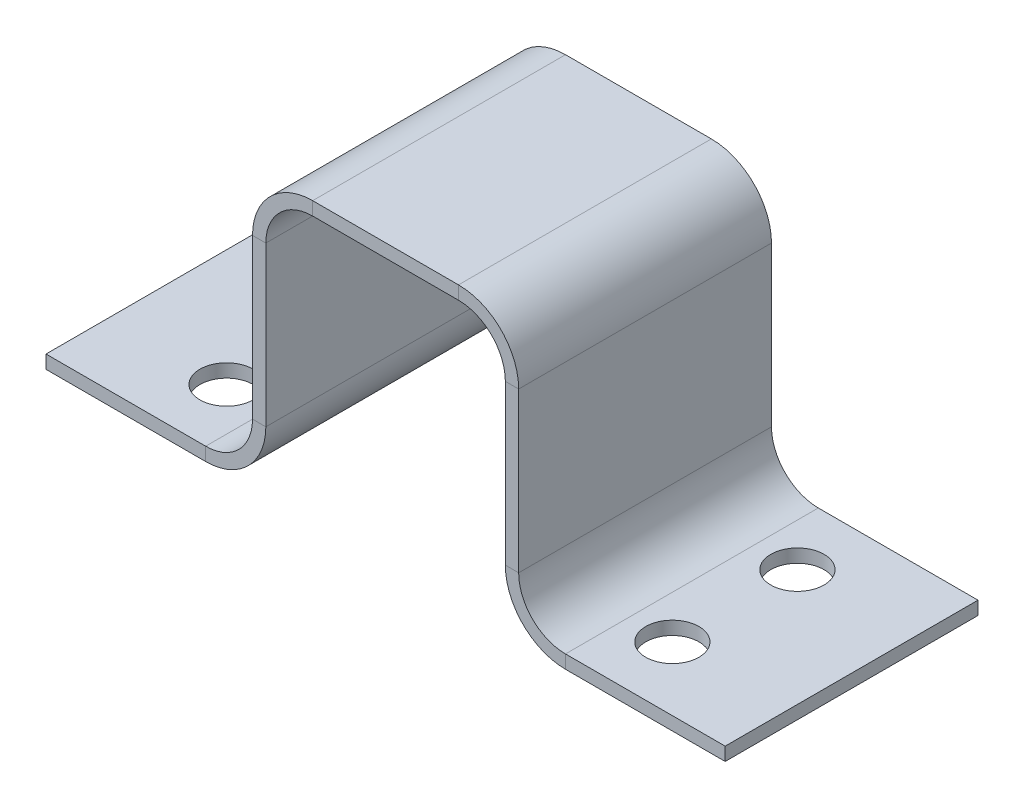
ISO-10303-21;
HEADER;
FILE_DESCRIPTION(('STEP AP214'),'2;1');
FILE_NAME('part.step','',(''),(''),'','','');
FILE_SCHEMA(('AUTOMOTIVE_DESIGN { 1 0 10303 214 1 1 1 1 }'));
ENDSEC;
DATA;
#1=APPLICATION_CONTEXT('core data for automotive mechanical design processes');
#2=APPLICATION_PROTOCOL_DEFINITION('international standard','automotive_design',2000,#1);
#3=PRODUCT_CONTEXT('',#1,'mechanical');
#4=PRODUCT('Part','Part','',(#3));
#5=PRODUCT_RELATED_PRODUCT_CATEGORY('part','',(#4));
#6=PRODUCT_DEFINITION_FORMATION('','',#4);
#7=PRODUCT_DEFINITION_CONTEXT('part definition',#1,'design');
#8=PRODUCT_DEFINITION('design','',#6,#7);
#9=PRODUCT_DEFINITION_SHAPE('','',#8);
#10=(LENGTH_UNIT() NAMED_UNIT(*) SI_UNIT(.MILLI.,.METRE.));
#11=(NAMED_UNIT(*) PLANE_ANGLE_UNIT() SI_UNIT($,.RADIAN.));
#12=(NAMED_UNIT(*) SI_UNIT($,.STERADIAN.) SOLID_ANGLE_UNIT());
#13=UNCERTAINTY_MEASURE_WITH_UNIT(LENGTH_MEASURE(1.E-05),#10,'distance_accuracy_value','');
#14=(GEOMETRIC_REPRESENTATION_CONTEXT(3) GLOBAL_UNCERTAINTY_ASSIGNED_CONTEXT((#13)) GLOBAL_UNIT_ASSIGNED_CONTEXT((#10,
#11,#12)) REPRESENTATION_CONTEXT('',''));
#15=CARTESIAN_POINT('',(0.,0.,0.));
#16=DIRECTION('',(0.,0.,1.));
#17=DIRECTION('',(1.,0.,0.));
#18=AXIS2_PLACEMENT_3D('',#15,#16,#17);
#19=CARTESIAN_POINT('',(-40.513,1.5875,15.08125));
#20=DIRECTION('',(-1.,0.,0.));
#21=DIRECTION('',(0.,0.,-1.));
#22=AXIS2_PLACEMENT_3D('',#19,#20,#21);
#23=PLANE('',#22);
#24=DIRECTION('',(0.,1.,0.));
#25=VECTOR('',#24,1.);
#26=CARTESIAN_POINT('',(-40.513,1.5875,-15.08125));
#27=LINE('',#26,#25);
#28=CARTESIAN_POINT('',(-40.513,0.,-15.08125));
#29=VERTEX_POINT('',#28);
#30=CARTESIAN_POINT('',(-40.513,1.5875,-15.08125));
#31=VERTEX_POINT('',#30);
#32=EDGE_CURVE('E11',#29,#31,#27,.T.);
#33=ORIENTED_EDGE('',*,*,#32,.F.);
#34=DIRECTION('',(0.,0.,-1.));
#35=VECTOR('',#34,1.);
#36=CARTESIAN_POINT('',(-40.513,0.,15.08125));
#37=LINE('',#36,#35);
#38=CARTESIAN_POINT('',(-40.513,0.,15.08125));
#39=VERTEX_POINT('',#38);
#40=EDGE_CURVE('E123',#39,#29,#37,.T.);
#41=ORIENTED_EDGE('',*,*,#40,.F.);
#42=DIRECTION('',(0.,1.,0.));
#43=VECTOR('',#42,1.);
#44=CARTESIAN_POINT('',(-40.513,1.5875,15.08125));
#45=LINE('',#44,#43);
#46=CARTESIAN_POINT('',(-40.513,1.5875,15.08125));
#47=VERTEX_POINT('',#46);
#48=EDGE_CURVE('E49',#39,#47,#45,.T.);
#49=ORIENTED_EDGE('',*,*,#48,.T.);
#50=DIRECTION('',(0.,0.,-1.));
#51=VECTOR('',#50,1.);
#52=CARTESIAN_POINT('',(-40.513,1.5875,15.08125));
#53=LINE('',#52,#51);
#54=EDGE_CURVE('E126',#47,#31,#53,.T.);
#55=ORIENTED_EDGE('',*,*,#54,.T.);
#56=EDGE_LOOP('',(#33,#41,#49,#55));
#57=FACE_BOUND('',#56,.T.);
#58=ADVANCED_FACE('F39',(#57),#23,.T.);
#59=CARTESIAN_POINT('',(-40.513,1.5875,15.08125));
#60=DIRECTION('',(0.,0.,1.));
#61=DIRECTION('',(-1.,0.,0.));
#62=AXIS2_PLACEMENT_3D('',#59,#60,#61);
#63=PLANE('',#62);
#64=ORIENTED_EDGE('',*,*,#48,.F.);
#65=DIRECTION('',(1.,0.,0.));
#66=VECTOR('',#65,1.);
#67=CARTESIAN_POINT('',(-40.513,0.,15.08125));
#68=LINE('',#67,#66);
#69=CARTESIAN_POINT('',(-21.463,0.,15.08125));
#70=VERTEX_POINT('',#69);
#71=EDGE_CURVE('E138',#70,#39,#68,.F.);
#72=ORIENTED_EDGE('',*,*,#71,.F.);
#73=DIRECTION('',(0.,1.,0.));
#74=VECTOR('',#73,1.);
#75=CARTESIAN_POINT('',(-21.463,1.5875,15.08125));
#76=LINE('',#75,#74);
#77=CARTESIAN_POINT('',(-21.463,1.5875,15.08125));
#78=VERTEX_POINT('',#77);
#79=EDGE_CURVE('E208',#70,#78,#76,.T.);
#80=ORIENTED_EDGE('',*,*,#79,.T.);
#81=DIRECTION('',(-1.,0.,0.));
#82=VECTOR('',#81,1.);
#83=CARTESIAN_POINT('',(-40.513,1.5875,15.08125));
#84=LINE('',#83,#82);
#85=EDGE_CURVE('E216',#78,#47,#84,.T.);
#86=ORIENTED_EDGE('',*,*,#85,.T.);
#87=EDGE_LOOP('',(#64,#72,#80,#86));
#88=FACE_BOUND('',#87,.T.);
#89=ADVANCED_FACE('F220',(#88),#63,.T.);
#90=CARTESIAN_POINT('',(-21.463,7.17549999999999,15.08125));
#91=DIRECTION('',(0.,0.,1.));
#92=DIRECTION('',(1.,0.,0.));
#93=AXIS2_PLACEMENT_3D('',#90,#91,#92);
#94=PLANE('',#93);
#95=ORIENTED_EDGE('',*,*,#79,.F.);
#96=CARTESIAN_POINT('',(-21.463,7.17549999999999,15.08125));
#97=DIRECTION('',(0.,0.,-1.));
#98=DIRECTION('',(-1.,0.,0.));
#99=AXIS2_PLACEMENT_3D('',#96,#97,#98);
#100=CIRCLE('',#99,7.1755);
#101=CARTESIAN_POINT('',(-14.2875,7.17549999999999,15.08125));
#102=VERTEX_POINT('',#101);
#103=EDGE_CURVE('E264',#102,#70,#100,.T.);
#104=ORIENTED_EDGE('',*,*,#103,.F.);
#105=DIRECTION('',(-1.,0.,0.));
#106=VECTOR('',#105,1.);
#107=CARTESIAN_POINT('',(-15.875,7.17549999999999,15.08125));
#108=LINE('',#107,#106);
#109=CARTESIAN_POINT('',(-15.875,7.17549999999999,15.08125));
#110=VERTEX_POINT('',#109);
#111=EDGE_CURVE('E205',#102,#110,#108,.T.);
#112=ORIENTED_EDGE('',*,*,#111,.T.);
#113=CARTESIAN_POINT('',(-21.463,7.17549999999999,15.08125));
#114=DIRECTION('',(0.,0.,-1.));
#115=DIRECTION('',(1.,0.,0.));
#116=AXIS2_PLACEMENT_3D('',#113,#114,#115);
#117=CIRCLE('',#116,5.588);
#118=EDGE_CURVE('E228',#110,#78,#117,.T.);
#119=ORIENTED_EDGE('',*,*,#118,.T.);
#120=EDGE_LOOP('',(#95,#104,#112,#119));
#121=FACE_BOUND('',#120,.T.);
#122=ADVANCED_FACE('F410',(#121),#94,.T.);
#123=CARTESIAN_POINT('',(-15.875,7.17549999999999,15.08125));
#124=DIRECTION('',(0.,0.,1.));
#125=DIRECTION('',(0.,-1.,0.));
#126=AXIS2_PLACEMENT_3D('',#123,#124,#125);
#127=PLANE('',#126);
#128=ORIENTED_EDGE('',*,*,#111,.F.);
#129=DIRECTION('',(0.,1.,0.));
#130=VECTOR('',#129,1.);
#131=CARTESIAN_POINT('',(-14.2875,7.17549999999999,15.08125));
#132=LINE('',#131,#130);
#133=CARTESIAN_POINT('',(-14.2875,26.162,15.08125));
#134=VERTEX_POINT('',#133);
#135=EDGE_CURVE('E236',#134,#102,#132,.F.);
#136=ORIENTED_EDGE('',*,*,#135,.F.);
#137=DIRECTION('',(-1.,0.,0.));
#138=VECTOR('',#137,1.);
#139=CARTESIAN_POINT('',(-15.875,26.162,15.08125));
#140=LINE('',#139,#138);
#141=CARTESIAN_POINT('',(-15.875,26.162,15.08125));
#142=VERTEX_POINT('',#141);
#143=EDGE_CURVE('E202',#134,#142,#140,.T.);
#144=ORIENTED_EDGE('',*,*,#143,.T.);
#145=DIRECTION('',(0.,-1.,0.));
#146=VECTOR('',#145,1.);
#147=CARTESIAN_POINT('',(-15.875,7.17549999999999,15.08125));
#148=LINE('',#147,#146);
#149=EDGE_CURVE('E344',#142,#110,#148,.T.);
#150=ORIENTED_EDGE('',*,*,#149,.T.);
#151=EDGE_LOOP('',(#128,#136,#144,#150));
#152=FACE_BOUND('',#151,.T.);
#153=ADVANCED_FACE('F543',(#152),#127,.T.);
#154=CARTESIAN_POINT('',(-8.6995,26.162,15.08125));
#155=DIRECTION('',(0.,0.,-1.));
#156=DIRECTION('',(-1.,0.,0.));
#157=AXIS2_PLACEMENT_3D('',#154,#155,#156);
#158=PLANE('',#157);
#159=ORIENTED_EDGE('',*,*,#143,.F.);
#160=CARTESIAN_POINT('',(-8.6995,26.162,15.08125));
#161=DIRECTION('',(0.,0.,-1.));
#162=DIRECTION('',(-1.,0.,0.));
#163=AXIS2_PLACEMENT_3D('',#160,#161,#162);
#164=CIRCLE('',#163,5.588);
#165=CARTESIAN_POINT('',(-8.6995,31.75,15.08125));
#166=VERTEX_POINT('',#165);
#167=EDGE_CURVE('E156',#166,#134,#164,.F.);
#168=ORIENTED_EDGE('',*,*,#167,.F.);
#169=DIRECTION('',(0.,1.,0.));
#170=VECTOR('',#169,1.);
#171=CARTESIAN_POINT('',(-8.6995,33.3375,15.08125));
#172=LINE('',#171,#170);
#173=CARTESIAN_POINT('',(-8.6995,33.3375,15.08125));
#174=VERTEX_POINT('',#173);
#175=EDGE_CURVE('E199',#166,#174,#172,.T.);
#176=ORIENTED_EDGE('',*,*,#175,.T.);
#177=CARTESIAN_POINT('',(-8.6995,26.162,15.08125));
#178=DIRECTION('',(0.,0.,1.));
#179=DIRECTION('',(-1.,0.,0.));
#180=AXIS2_PLACEMENT_3D('',#177,#178,#179);
#181=CIRCLE('',#180,7.1755);
#182=EDGE_CURVE('E353',#174,#142,#181,.T.);
#183=ORIENTED_EDGE('',*,*,#182,.T.);
#184=EDGE_LOOP('',(#159,#168,#176,#183));
#185=FACE_BOUND('',#184,.T.);
#186=ADVANCED_FACE('F540',(#185),#158,.F.);
#187=CARTESIAN_POINT('',(-8.6995,33.3375,15.08125));
#188=DIRECTION('',(0.,0.,1.));
#189=DIRECTION('',(-1.,0.,0.));
#190=AXIS2_PLACEMENT_3D('',#187,#188,#189);
#191=PLANE('',#190);
#192=ORIENTED_EDGE('',*,*,#175,.F.);
#193=DIRECTION('',(1.,0.,0.));
#194=VECTOR('',#193,1.);
#195=CARTESIAN_POINT('',(-8.6995,31.75,15.08125));
#196=LINE('',#195,#194);
#197=CARTESIAN_POINT('',(8.69949999999999,31.75,15.08125));
#198=VERTEX_POINT('',#197);
#199=EDGE_CURVE('E245',#198,#166,#196,.F.);
#200=ORIENTED_EDGE('',*,*,#199,.F.);
#201=DIRECTION('',(0.,1.,0.));
#202=VECTOR('',#201,1.);
#203=CARTESIAN_POINT('',(8.6995,33.3375,15.08125));
#204=LINE('',#203,#202);
#205=CARTESIAN_POINT('',(8.6995,33.3375,15.08125));
#206=VERTEX_POINT('',#205);
#207=EDGE_CURVE('E196',#198,#206,#204,.T.);
#208=ORIENTED_EDGE('',*,*,#207,.T.);
#209=DIRECTION('',(-1.,0.,0.));
#210=VECTOR('',#209,1.);
#211=CARTESIAN_POINT('',(-8.6995,33.3375,15.08125));
#212=LINE('',#211,#210);
#213=EDGE_CURVE('E313',#206,#174,#212,.T.);
#214=ORIENTED_EDGE('',*,*,#213,.T.);
#215=EDGE_LOOP('',(#192,#200,#208,#214));
#216=FACE_BOUND('',#215,.T.);
#217=ADVANCED_FACE('F538',(#216),#191,.T.);
#218=CARTESIAN_POINT('',(8.69950000000001,26.162,15.08125));
#219=DIRECTION('',(0.,0.,-1.));
#220=DIRECTION('',(-1.,0.,0.));
#221=AXIS2_PLACEMENT_3D('',#218,#219,#220);
#222=PLANE('',#221);
#223=ORIENTED_EDGE('',*,*,#207,.F.);
#224=CARTESIAN_POINT('',(8.69950000000001,26.162,15.08125));
#225=DIRECTION('',(0.,0.,-1.));
#226=DIRECTION('',(-1.,0.,0.));
#227=AXIS2_PLACEMENT_3D('',#224,#225,#226);
#228=CIRCLE('',#227,5.588);
#229=CARTESIAN_POINT('',(14.2875,26.162,15.08125));
#230=VERTEX_POINT('',#229);
#231=EDGE_CURVE('E267',#230,#198,#228,.F.);
#232=ORIENTED_EDGE('',*,*,#231,.F.);
#233=DIRECTION('',(1.,0.,0.));
#234=VECTOR('',#233,1.);
#235=CARTESIAN_POINT('',(15.875,26.162,15.08125));
#236=LINE('',#235,#234);
#237=CARTESIAN_POINT('',(15.875,26.162,15.08125));
#238=VERTEX_POINT('',#237);
#239=EDGE_CURVE('E193',#230,#238,#236,.T.);
#240=ORIENTED_EDGE('',*,*,#239,.T.);
#241=CARTESIAN_POINT('',(8.69950000000001,26.162,15.08125));
#242=DIRECTION('',(0.,0.,1.));
#243=DIRECTION('',(-1.,0.,0.));
#244=AXIS2_PLACEMENT_3D('',#241,#242,#243);
#245=CIRCLE('',#244,7.1755);
#246=EDGE_CURVE('E335',#238,#206,#245,.T.);
#247=ORIENTED_EDGE('',*,*,#246,.T.);
#248=EDGE_LOOP('',(#223,#232,#240,#247));
#249=FACE_BOUND('',#248,.T.);
#250=ADVANCED_FACE('F526',(#249),#222,.F.);
#251=CARTESIAN_POINT('',(15.875,26.162,15.08125));
#252=DIRECTION('',(0.,0.,1.));
#253=DIRECTION('',(0.,1.,0.));
#254=AXIS2_PLACEMENT_3D('',#251,#252,#253);
#255=PLANE('',#254);
#256=ORIENTED_EDGE('',*,*,#239,.F.);
#257=DIRECTION('',(0.,-1.,0.));
#258=VECTOR('',#257,1.);
#259=CARTESIAN_POINT('',(14.2875,26.162,15.08125));
#260=LINE('',#259,#258);
#261=CARTESIAN_POINT('',(14.2875,7.1755,15.08125));
#262=VERTEX_POINT('',#261);
#263=EDGE_CURVE('E254',#262,#230,#260,.F.);
#264=ORIENTED_EDGE('',*,*,#263,.F.);
#265=DIRECTION('',(1.,0.,0.));
#266=VECTOR('',#265,1.);
#267=CARTESIAN_POINT('',(15.875,7.1755,15.08125));
#268=LINE('',#267,#266);
#269=CARTESIAN_POINT('',(15.875,7.1755,15.08125));
#270=VERTEX_POINT('',#269);
#271=EDGE_CURVE('E190',#262,#270,#268,.T.);
#272=ORIENTED_EDGE('',*,*,#271,.T.);
#273=DIRECTION('',(0.,1.,0.));
#274=VECTOR('',#273,1.);
#275=CARTESIAN_POINT('',(15.875,26.162,15.08125));
#276=LINE('',#275,#274);
#277=EDGE_CURVE('E326',#270,#238,#276,.T.);
#278=ORIENTED_EDGE('',*,*,#277,.T.);
#279=EDGE_LOOP('',(#256,#264,#272,#278));
#280=FACE_BOUND('',#279,.T.);
#281=ADVANCED_FACE('F603',(#280),#255,.T.);
#282=CARTESIAN_POINT('',(21.463,7.1755,15.08125));
#283=DIRECTION('',(0.,0.,1.));
#284=DIRECTION('',(1.,0.,0.));
#285=AXIS2_PLACEMENT_3D('',#282,#283,#284);
#286=PLANE('',#285);
#287=ORIENTED_EDGE('',*,*,#271,.F.);
#288=CARTESIAN_POINT('',(21.463,7.1755,15.08125));
#289=DIRECTION('',(0.,0.,-1.));
#290=DIRECTION('',(-1.,0.,0.));
#291=AXIS2_PLACEMENT_3D('',#288,#289,#290);
#292=CIRCLE('',#291,7.1755);
#293=CARTESIAN_POINT('',(21.463,0.,15.08125));
#294=VERTEX_POINT('',#293);
#295=EDGE_CURVE('E150',#294,#262,#292,.T.);
#296=ORIENTED_EDGE('',*,*,#295,.F.);
#297=DIRECTION('',(0.,1.,0.));
#298=VECTOR('',#297,1.);
#299=CARTESIAN_POINT('',(21.463,1.5875,15.08125));
#300=LINE('',#299,#298);
#301=CARTESIAN_POINT('',(21.463,1.5875,15.08125));
#302=VERTEX_POINT('',#301);
#303=EDGE_CURVE('E187',#294,#302,#300,.T.);
#304=ORIENTED_EDGE('',*,*,#303,.T.);
#305=CARTESIAN_POINT('',(21.463,7.1755,15.08125));
#306=DIRECTION('',(0.,0.,-1.));
#307=DIRECTION('',(1.,0.,0.));
#308=AXIS2_PLACEMENT_3D('',#305,#306,#307);
#309=CIRCLE('',#308,5.588);
#310=EDGE_CURVE('E377',#302,#270,#309,.T.);
#311=ORIENTED_EDGE('',*,*,#310,.T.);
#312=EDGE_LOOP('',(#287,#296,#304,#311));
#313=FACE_BOUND('',#312,.T.);
#314=ADVANCED_FACE('F600',(#313),#286,.T.);
#315=CARTESIAN_POINT('',(21.463,1.5875,15.08125));
#316=DIRECTION('',(0.,0.,1.));
#317=DIRECTION('',(-1.,0.,0.));
#318=AXIS2_PLACEMENT_3D('',#315,#316,#317);
#319=PLANE('',#318);
#320=ORIENTED_EDGE('',*,*,#303,.F.);
#321=DIRECTION('',(1.,0.,0.));
#322=VECTOR('',#321,1.);
#323=CARTESIAN_POINT('',(21.463,0.,15.08125));
#324=LINE('',#323,#322);
#325=CARTESIAN_POINT('',(40.513,0.,15.08125));
#326=VERTEX_POINT('',#325);
#327=EDGE_CURVE('E262',#326,#294,#324,.F.);
#328=ORIENTED_EDGE('',*,*,#327,.F.);
#329=DIRECTION('',(0.,1.,0.));
#330=VECTOR('',#329,1.);
#331=CARTESIAN_POINT('',(40.513,1.5875,15.08125));
#332=LINE('',#331,#330);
#333=CARTESIAN_POINT('',(40.513,1.5875,15.08125));
#334=VERTEX_POINT('',#333);
#335=EDGE_CURVE('E184',#326,#334,#332,.T.);
#336=ORIENTED_EDGE('',*,*,#335,.T.);
#337=DIRECTION('',(-1.,0.,0.));
#338=VECTOR('',#337,1.);
#339=CARTESIAN_POINT('',(21.463,1.5875,15.08125));
#340=LINE('',#339,#338);
#341=EDGE_CURVE('E368',#334,#302,#340,.T.);
#342=ORIENTED_EDGE('',*,*,#341,.T.);
#343=EDGE_LOOP('',(#320,#328,#336,#342));
#344=FACE_BOUND('',#343,.T.);
#345=ADVANCED_FACE('F457',(#344),#319,.T.);
#346=CARTESIAN_POINT('',(40.513,1.5875,15.08125));
#347=DIRECTION('',(-1.,0.,0.));
#348=DIRECTION('',(0.,0.,-1.));
#349=AXIS2_PLACEMENT_3D('',#346,#347,#348);
#350=PLANE('',#349);
#351=ORIENTED_EDGE('',*,*,#335,.F.);
#352=DIRECTION('',(0.,0.,1.));
#353=VECTOR('',#352,1.);
#354=CARTESIAN_POINT('',(40.513,0.,15.08125));
#355=LINE('',#354,#353);
#356=CARTESIAN_POINT('',(40.513,0.,-15.08125));
#357=VERTEX_POINT('',#356);
#358=EDGE_CURVE('E279',#326,#357,#355,.F.);
#359=ORIENTED_EDGE('',*,*,#358,.T.);
#360=DIRECTION('',(0.,1.,0.));
#361=VECTOR('',#360,1.);
#362=CARTESIAN_POINT('',(40.513,1.5875,-15.08125));
#363=LINE('',#362,#361);
#364=CARTESIAN_POINT('',(40.513,1.5875,-15.08125));
#365=VERTEX_POINT('',#364);
#366=EDGE_CURVE('E181',#357,#365,#363,.T.);
#367=ORIENTED_EDGE('',*,*,#366,.T.);
#368=DIRECTION('',(0.,0.,-1.));
#369=VECTOR('',#368,1.);
#370=CARTESIAN_POINT('',(40.513,1.5875,15.08125));
#371=LINE('',#370,#369);
#372=EDGE_CURVE('E371',#334,#365,#371,.T.);
#373=ORIENTED_EDGE('',*,*,#372,.F.);
#374=EDGE_LOOP('',(#351,#359,#367,#373));
#375=FACE_BOUND('',#374,.T.);
#376=ADVANCED_FACE('F451',(#375),#350,.F.);
#377=CARTESIAN_POINT('',(21.463,1.5875,-15.08125));
#378=DIRECTION('',(0.,0.,1.));
#379=DIRECTION('',(-1.,0.,0.));
#380=AXIS2_PLACEMENT_3D('',#377,#378,#379);
#381=PLANE('',#380);
#382=ORIENTED_EDGE('',*,*,#366,.F.);
#383=DIRECTION('',(1.,0.,0.));
#384=VECTOR('',#383,1.);
#385=CARTESIAN_POINT('',(21.463,0.,-15.08125));
#386=LINE('',#385,#384);
#387=CARTESIAN_POINT('',(21.463,0.,-15.08125));
#388=VERTEX_POINT('',#387);
#389=EDGE_CURVE('E159',#357,#388,#386,.F.);
#390=ORIENTED_EDGE('',*,*,#389,.T.);
#391=DIRECTION('',(0.,1.,0.));
#392=VECTOR('',#391,1.);
#393=CARTESIAN_POINT('',(21.463,1.5875,-15.08125));
#394=LINE('',#393,#392);
#395=CARTESIAN_POINT('',(21.463,1.5875,-15.08125));
#396=VERTEX_POINT('',#395);
#397=EDGE_CURVE('E178',#388,#396,#394,.T.);
#398=ORIENTED_EDGE('',*,*,#397,.T.);
#399=DIRECTION('',(-1.,0.,0.));
#400=VECTOR('',#399,1.);
#401=CARTESIAN_POINT('',(21.463,1.5875,-15.08125));
#402=LINE('',#401,#400);
#403=EDGE_CURVE('E362',#365,#396,#402,.T.);
#404=ORIENTED_EDGE('',*,*,#403,.F.);
#405=EDGE_LOOP('',(#382,#390,#398,#404));
#406=FACE_BOUND('',#405,.T.);
#407=ADVANCED_FACE('F592',(#406),#381,.F.);
#408=CARTESIAN_POINT('',(21.463,7.1755,-15.08125));
#409=DIRECTION('',(0.,0.,1.));
#410=DIRECTION('',(1.,0.,0.));
#411=AXIS2_PLACEMENT_3D('',#408,#409,#410);
#412=PLANE('',#411);
#413=ORIENTED_EDGE('',*,*,#397,.F.);
#414=CARTESIAN_POINT('',(21.463,7.1755,-15.08125));
#415=DIRECTION('',(0.,0.,-1.));
#416=DIRECTION('',(-1.,0.,0.));
#417=AXIS2_PLACEMENT_3D('',#414,#415,#416);
#418=CIRCLE('',#417,7.1755);
#419=CARTESIAN_POINT('',(14.2875,7.1755,-15.08125));
#420=VERTEX_POINT('',#419);
#421=EDGE_CURVE('E276',#388,#420,#418,.T.);
#422=ORIENTED_EDGE('',*,*,#421,.T.);
#423=DIRECTION('',(1.,0.,0.));
#424=VECTOR('',#423,1.);
#425=CARTESIAN_POINT('',(15.875,7.1755,-15.08125));
#426=LINE('',#425,#424);
#427=CARTESIAN_POINT('',(15.875,7.1755,-15.08125));
#428=VERTEX_POINT('',#427);
#429=EDGE_CURVE('E175',#420,#428,#426,.T.);
#430=ORIENTED_EDGE('',*,*,#429,.T.);
#431=CARTESIAN_POINT('',(21.463,7.1755,-15.08125));
#432=DIRECTION('',(0.,0.,-1.));
#433=DIRECTION('',(1.,0.,0.));
#434=AXIS2_PLACEMENT_3D('',#431,#432,#433);
#435=CIRCLE('',#434,5.588);
#436=EDGE_CURVE('E374',#396,#428,#435,.T.);
#437=ORIENTED_EDGE('',*,*,#436,.F.);
#438=EDGE_LOOP('',(#413,#422,#430,#437));
#439=FACE_BOUND('',#438,.T.);
#440=ADVANCED_FACE('F588',(#439),#412,.F.);
#441=CARTESIAN_POINT('',(15.875,26.162,-15.08125));
#442=DIRECTION('',(0.,0.,1.));
#443=DIRECTION('',(0.,1.,0.));
#444=AXIS2_PLACEMENT_3D('',#441,#442,#443);
#445=PLANE('',#444);
#446=ORIENTED_EDGE('',*,*,#429,.F.);
#447=DIRECTION('',(0.,-1.,0.));
#448=VECTOR('',#447,1.);
#449=CARTESIAN_POINT('',(14.2875,26.162,-15.08125));
#450=LINE('',#449,#448);
#451=CARTESIAN_POINT('',(14.2875,26.162,-15.08125));
#452=VERTEX_POINT('',#451);
#453=EDGE_CURVE('E250',#420,#452,#450,.F.);
#454=ORIENTED_EDGE('',*,*,#453,.T.);
#455=DIRECTION('',(1.,0.,0.));
#456=VECTOR('',#455,1.);
#457=CARTESIAN_POINT('',(15.875,26.162,-15.08125));
#458=LINE('',#457,#456);
#459=CARTESIAN_POINT('',(15.875,26.162,-15.08125));
#460=VERTEX_POINT('',#459);
#461=EDGE_CURVE('E172',#452,#460,#458,.T.);
#462=ORIENTED_EDGE('',*,*,#461,.T.);
#463=DIRECTION('',(0.,1.,0.));
#464=VECTOR('',#463,1.);
#465=CARTESIAN_POINT('',(15.875,26.162,-15.08125));
#466=LINE('',#465,#464);
#467=EDGE_CURVE('E320',#428,#460,#466,.T.);
#468=ORIENTED_EDGE('',*,*,#467,.F.);
#469=EDGE_LOOP('',(#446,#454,#462,#468));
#470=FACE_BOUND('',#469,.T.);
#471=ADVANCED_FACE('F585',(#470),#445,.F.);
#472=CARTESIAN_POINT('',(8.69950000000001,26.162,-15.08125));
#473=DIRECTION('',(0.,0.,-1.));
#474=DIRECTION('',(-1.,0.,0.));
#475=AXIS2_PLACEMENT_3D('',#472,#473,#474);
#476=PLANE('',#475);
#477=ORIENTED_EDGE('',*,*,#461,.F.);
#478=CARTESIAN_POINT('',(8.69950000000001,26.162,-15.08125));
#479=DIRECTION('',(0.,0.,-1.));
#480=DIRECTION('',(-1.,0.,0.));
#481=AXIS2_PLACEMENT_3D('',#478,#479,#480);
#482=CIRCLE('',#481,5.588);
#483=CARTESIAN_POINT('',(8.6995,31.75,-15.08125));
#484=VERTEX_POINT('',#483);
#485=EDGE_CURVE('E258',#452,#484,#482,.F.);
#486=ORIENTED_EDGE('',*,*,#485,.T.);
#487=DIRECTION('',(0.,1.,0.));
#488=VECTOR('',#487,1.);
#489=CARTESIAN_POINT('',(8.6995,33.3375,-15.08125));
#490=LINE('',#489,#488);
#491=CARTESIAN_POINT('',(8.6995,33.3375,-15.08125));
#492=VERTEX_POINT('',#491);
#493=EDGE_CURVE('E169',#484,#492,#490,.T.);
#494=ORIENTED_EDGE('',*,*,#493,.T.);
#495=CARTESIAN_POINT('',(8.69950000000001,26.162,-15.08125));
#496=DIRECTION('',(0.,0.,1.));
#497=DIRECTION('',(-1.,0.,0.));
#498=AXIS2_PLACEMENT_3D('',#495,#496,#497);
#499=CIRCLE('',#498,7.1755);
#500=EDGE_CURVE('E332',#460,#492,#499,.T.);
#501=ORIENTED_EDGE('',*,*,#500,.F.);
#502=EDGE_LOOP('',(#477,#486,#494,#501));
#503=FACE_BOUND('',#502,.T.);
#504=ADVANCED_FACE('F533',(#503),#476,.T.);
#505=CARTESIAN_POINT('',(-8.6995,33.3375,-15.08125));
#506=DIRECTION('',(0.,0.,1.));
#507=DIRECTION('',(-1.,0.,0.));
#508=AXIS2_PLACEMENT_3D('',#505,#506,#507);
#509=PLANE('',#508);
#510=ORIENTED_EDGE('',*,*,#493,.F.);
#511=DIRECTION('',(1.,0.,0.));
#512=VECTOR('',#511,1.);
#513=CARTESIAN_POINT('',(-8.6995,31.75,-15.08125));
#514=LINE('',#513,#512);
#515=CARTESIAN_POINT('',(-8.6995,31.75,-15.08125));
#516=VERTEX_POINT('',#515);
#517=EDGE_CURVE('E246',#484,#516,#514,.F.);
#518=ORIENTED_EDGE('',*,*,#517,.T.);
#519=DIRECTION('',(0.,1.,0.));
#520=VECTOR('',#519,1.);
#521=CARTESIAN_POINT('',(-8.6995,33.3375,-15.08125));
#522=LINE('',#521,#520);
#523=CARTESIAN_POINT('',(-8.6995,33.3375,-15.08125));
#524=VERTEX_POINT('',#523);
#525=EDGE_CURVE('E166',#516,#524,#522,.T.);
#526=ORIENTED_EDGE('',*,*,#525,.T.);
#527=DIRECTION('',(-1.,0.,0.));
#528=VECTOR('',#527,1.);
#529=CARTESIAN_POINT('',(-8.6995,33.3375,-15.08125));
#530=LINE('',#529,#528);
#531=EDGE_CURVE('E299',#492,#524,#530,.T.);
#532=ORIENTED_EDGE('',*,*,#531,.F.);
#533=EDGE_LOOP('',(#510,#518,#526,#532));
#534=FACE_BOUND('',#533,.T.);
#535=ADVANCED_FACE('F496',(#534),#509,.F.);
#536=CARTESIAN_POINT('',(-8.6995,26.162,-15.08125));
#537=DIRECTION('',(0.,0.,-1.));
#538=DIRECTION('',(-1.,0.,0.));
#539=AXIS2_PLACEMENT_3D('',#536,#537,#538);
#540=PLANE('',#539);
#541=ORIENTED_EDGE('',*,*,#525,.F.);
#542=CARTESIAN_POINT('',(-8.6995,26.162,-15.08125));
#543=DIRECTION('',(0.,0.,-1.));
#544=DIRECTION('',(-1.,0.,0.));
#545=AXIS2_PLACEMENT_3D('',#542,#543,#544);
#546=CIRCLE('',#545,5.588);
#547=CARTESIAN_POINT('',(-14.2875,26.162,-15.08125));
#548=VERTEX_POINT('',#547);
#549=EDGE_CURVE('E241',#516,#548,#546,.F.);
#550=ORIENTED_EDGE('',*,*,#549,.T.);
#551=DIRECTION('',(-1.,0.,0.));
#552=VECTOR('',#551,1.);
#553=CARTESIAN_POINT('',(-15.875,26.162,-15.08125));
#554=LINE('',#553,#552);
#555=CARTESIAN_POINT('',(-15.875,26.162,-15.08125));
#556=VERTEX_POINT('',#555);
#557=EDGE_CURVE('E163',#548,#556,#554,.T.);
#558=ORIENTED_EDGE('',*,*,#557,.T.);
#559=CARTESIAN_POINT('',(-8.6995,26.162,-15.08125));
#560=DIRECTION('',(0.,0.,1.));
#561=DIRECTION('',(-1.,0.,0.));
#562=AXIS2_PLACEMENT_3D('',#559,#560,#561);
#563=CIRCLE('',#562,7.1755);
#564=EDGE_CURVE('E350',#524,#556,#563,.T.);
#565=ORIENTED_EDGE('',*,*,#564,.F.);
#566=EDGE_LOOP('',(#541,#550,#558,#565));
#567=FACE_BOUND('',#566,.T.);
#568=ADVANCED_FACE('F499',(#567),#540,.T.);
#569=CARTESIAN_POINT('',(-15.875,7.17549999999999,-15.08125));
#570=DIRECTION('',(0.,0.,1.));
#571=DIRECTION('',(0.,-1.,0.));
#572=AXIS2_PLACEMENT_3D('',#569,#570,#571);
#573=PLANE('',#572);
#574=ORIENTED_EDGE('',*,*,#557,.F.);
#575=DIRECTION('',(0.,1.,0.));
#576=VECTOR('',#575,1.);
#577=CARTESIAN_POINT('',(-14.2875,7.17549999999999,-15.08125));
#578=LINE('',#577,#576);
#579=CARTESIAN_POINT('',(-14.2875,7.17549999999999,-15.08125));
#580=VERTEX_POINT('',#579);
#581=EDGE_CURVE('E237',#548,#580,#578,.F.);
#582=ORIENTED_EDGE('',*,*,#581,.T.);
#583=DIRECTION('',(-1.,0.,0.));
#584=VECTOR('',#583,1.);
#585=CARTESIAN_POINT('',(-15.875,7.17549999999999,-15.08125));
#586=LINE('',#585,#584);
#587=CARTESIAN_POINT('',(-15.875,7.17549999999999,-15.08125));
#588=VERTEX_POINT('',#587);
#589=EDGE_CURVE('E160',#580,#588,#586,.T.);
#590=ORIENTED_EDGE('',*,*,#589,.T.);
#591=DIRECTION('',(0.,-1.,0.));
#592=VECTOR('',#591,1.);
#593=CARTESIAN_POINT('',(-15.875,7.17549999999999,-15.08125));
#594=LINE('',#593,#592);
#595=EDGE_CURVE('E338',#556,#588,#594,.T.);
#596=ORIENTED_EDGE('',*,*,#595,.F.);
#597=EDGE_LOOP('',(#574,#582,#590,#596));
#598=FACE_BOUND('',#597,.T.);
#599=ADVANCED_FACE('F430',(#598),#573,.F.);
#600=CARTESIAN_POINT('',(-21.463,7.17549999999999,-15.08125));
#601=DIRECTION('',(0.,0.,1.));
#602=DIRECTION('',(1.,0.,0.));
#603=AXIS2_PLACEMENT_3D('',#600,#601,#602);
#604=PLANE('',#603);
#605=ORIENTED_EDGE('',*,*,#589,.F.);
#606=CARTESIAN_POINT('',(-21.463,7.17549999999999,-15.08125));
#607=DIRECTION('',(0.,0.,-1.));
#608=DIRECTION('',(-1.,0.,0.));
#609=AXIS2_PLACEMENT_3D('',#606,#607,#608);
#610=CIRCLE('',#609,7.1755);
#611=CARTESIAN_POINT('',(-21.463,0.,-15.08125));
#612=VERTEX_POINT('',#611);
#613=EDGE_CURVE('E232',#580,#612,#610,.T.);
#614=ORIENTED_EDGE('',*,*,#613,.T.);
#615=DIRECTION('',(0.,1.,0.));
#616=VECTOR('',#615,1.);
#617=CARTESIAN_POINT('',(-21.463,1.5875,-15.08125));
#618=LINE('',#617,#616);
#619=CARTESIAN_POINT('',(-21.463,1.5875,-15.08125));
#620=VERTEX_POINT('',#619);
#621=EDGE_CURVE('E43',#612,#620,#618,.T.);
#622=ORIENTED_EDGE('',*,*,#621,.T.);
#623=CARTESIAN_POINT('',(-21.463,7.17549999999999,-15.08125));
#624=DIRECTION('',(0.,0.,-1.));
#625=DIRECTION('',(1.,0.,0.));
#626=AXIS2_PLACEMENT_3D('',#623,#624,#625);
#627=CIRCLE('',#626,5.588);
#628=EDGE_CURVE('E223',#588,#620,#627,.T.);
#629=ORIENTED_EDGE('',*,*,#628,.F.);
#630=EDGE_LOOP('',(#605,#614,#622,#629));
#631=FACE_BOUND('',#630,.T.);
#632=ADVANCED_FACE('F423',(#631),#604,.F.);
#633=CARTESIAN_POINT('',(26.590625,1.5875,-7.46125));
#634=DIRECTION('',(0.,-1.,0.));
#635=DIRECTION('',(1.,0.,0.));
#636=AXIS2_PLACEMENT_3D('',#633,#634,#635);
#637=CYLINDRICAL_SURFACE('',#636,3.175);
#638=CARTESIAN_POINT('',(26.590625,1.5875,-7.46125));
#639=DIRECTION('',(0.,1.,0.));
#640=DIRECTION('',(0.,0.,1.));
#641=AXIS2_PLACEMENT_3D('',#638,#639,#640);
#642=CIRCLE('',#641,3.175);
#643=CARTESIAN_POINT('',(26.590625,1.5875,-4.28625));
#644=VERTEX_POINT('',#643);
#645=EDGE_CURVE('E356',#644,#644,#642,.T.);
#646=ORIENTED_EDGE('',*,*,#645,.T.);
#647=EDGE_LOOP('',(#646));
#648=FACE_BOUND('',#647,.T.);
#649=CARTESIAN_POINT('',(26.590625,0.,-7.46125));
#650=DIRECTION('',(0.,1.,0.));
#651=DIRECTION('',(0.,0.,1.));
#652=AXIS2_PLACEMENT_3D('',#649,#650,#651);
#653=CIRCLE('',#652,3.175);
#654=CARTESIAN_POINT('',(26.590625,0.,-4.28625));
#655=VERTEX_POINT('',#654);
#656=EDGE_CURVE('E152',#655,#655,#653,.T.);
#657=ORIENTED_EDGE('',*,*,#656,.F.);
#658=EDGE_LOOP('',(#657));
#659=FACE_BOUND('',#658,.T.);
#660=ADVANCED_FACE('F421',(#648,#659),#637,.F.);
#661=CARTESIAN_POINT('',(26.590625,1.5875,7.46125));
#662=DIRECTION('',(0.,-1.,0.));
#663=DIRECTION('',(1.,0.,0.));
#664=AXIS2_PLACEMENT_3D('',#661,#662,#663);
#665=CYLINDRICAL_SURFACE('',#664,3.175);
#666=CARTESIAN_POINT('',(26.590625,1.5875,7.46125));
#667=DIRECTION('',(0.,1.,0.));
#668=DIRECTION('',(0.,0.,1.));
#669=AXIS2_PLACEMENT_3D('',#666,#667,#668);
#670=CIRCLE('',#669,3.175);
#671=CARTESIAN_POINT('',(26.590625,1.5875,10.63625));
#672=VERTEX_POINT('',#671);
#673=EDGE_CURVE('E359',#672,#672,#670,.T.);
#674=ORIENTED_EDGE('',*,*,#673,.T.);
#675=EDGE_LOOP('',(#674));
#676=FACE_BOUND('',#675,.T.);
#677=CARTESIAN_POINT('',(26.590625,0.,7.46125));
#678=DIRECTION('',(0.,1.,0.));
#679=DIRECTION('',(0.,0.,1.));
#680=AXIS2_PLACEMENT_3D('',#677,#678,#679);
#681=CIRCLE('',#680,3.175);
#682=CARTESIAN_POINT('',(26.590625,0.,10.63625));
#683=VERTEX_POINT('',#682);
#684=EDGE_CURVE('E155',#683,#683,#681,.T.);
#685=ORIENTED_EDGE('',*,*,#684,.F.);
#686=EDGE_LOOP('',(#685));
#687=FACE_BOUND('',#686,.T.);
#688=ADVANCED_FACE('F41',(#676,#687),#665,.F.);
#689=CARTESIAN_POINT('',(-26.590625,1.5875,7.46125));
#690=DIRECTION('',(0.,-1.,0.));
#691=DIRECTION('',(0.,0.,-1.));
#692=AXIS2_PLACEMENT_3D('',#689,#690,#691);
#693=CYLINDRICAL_SURFACE('',#692,3.175);
#694=CARTESIAN_POINT('',(-26.590625,1.5875,7.46125));
#695=DIRECTION('',(0.,1.,0.));
#696=DIRECTION('',(0.,0.,1.));
#697=AXIS2_PLACEMENT_3D('',#694,#695,#696);
#698=CIRCLE('',#697,3.175);
#699=CARTESIAN_POINT('',(-26.590625,1.5875,10.63625));
#700=VERTEX_POINT('',#699);
#701=EDGE_CURVE('E380',#700,#700,#698,.T.);
#702=ORIENTED_EDGE('',*,*,#701,.T.);
#703=EDGE_LOOP('',(#702));
#704=FACE_BOUND('',#703,.T.);
#705=CARTESIAN_POINT('',(-26.590625,0.,7.46125));
#706=DIRECTION('',(0.,1.,0.));
#707=DIRECTION('',(0.,0.,1.));
#708=AXIS2_PLACEMENT_3D('',#705,#706,#707);
#709=CIRCLE('',#708,3.175);
#710=CARTESIAN_POINT('',(-26.590625,0.,10.63625));
#711=VERTEX_POINT('',#710);
#712=EDGE_CURVE('E145',#711,#711,#709,.T.);
#713=ORIENTED_EDGE('',*,*,#712,.F.);
#714=EDGE_LOOP('',(#713));
#715=FACE_BOUND('',#714,.T.);
#716=ADVANCED_FACE('F416',(#704,#715),#693,.F.);
#717=CARTESIAN_POINT('',(-26.590625,1.5875,-7.46125));
#718=DIRECTION('',(0.,-1.,0.));
#719=DIRECTION('',(0.,0.,-1.));
#720=AXIS2_PLACEMENT_3D('',#717,#718,#719);
#721=CYLINDRICAL_SURFACE('',#720,3.175);
#722=CARTESIAN_POINT('',(-26.590625,1.5875,-7.46125));
#723=DIRECTION('',(0.,1.,0.));
#724=DIRECTION('',(0.,0.,1.));
#725=AXIS2_PLACEMENT_3D('',#722,#723,#724);
#726=CIRCLE('',#725,3.175);
#727=CARTESIAN_POINT('',(-26.590625,1.5875,-4.28625));
#728=VERTEX_POINT('',#727);
#729=EDGE_CURVE('E383',#728,#728,#726,.T.);
#730=ORIENTED_EDGE('',*,*,#729,.T.);
#731=EDGE_LOOP('',(#730));
#732=FACE_BOUND('',#731,.T.);
#733=CARTESIAN_POINT('',(-26.590625,0.,-7.46125));
#734=DIRECTION('',(0.,1.,0.));
#735=DIRECTION('',(0.,0.,1.));
#736=AXIS2_PLACEMENT_3D('',#733,#734,#735);
#737=CIRCLE('',#736,3.175);
#738=CARTESIAN_POINT('',(-26.590625,0.,-4.28625));
#739=VERTEX_POINT('',#738);
#740=EDGE_CURVE('E142',#739,#739,#737,.T.);
#741=ORIENTED_EDGE('',*,*,#740,.F.);
#742=EDGE_LOOP('',(#741));
#743=FACE_BOUND('',#742,.T.);
#744=ADVANCED_FACE('F387',(#732,#743),#721,.F.);
#745=CARTESIAN_POINT('',(-40.513,1.5875,-15.08125));
#746=DIRECTION('',(0.,0.,1.));
#747=DIRECTION('',(-1.,0.,0.));
#748=AXIS2_PLACEMENT_3D('',#745,#746,#747);
#749=PLANE('',#748);
#750=DIRECTION('',(1.,0.,0.));
#751=VECTOR('',#750,1.);
#752=CARTESIAN_POINT('',(-40.513,0.,-15.08125));
#753=LINE('',#752,#751);
#754=EDGE_CURVE('E136',#612,#29,#753,.F.);
#755=ORIENTED_EDGE('',*,*,#754,.T.);
#756=ORIENTED_EDGE('',*,*,#32,.T.);
#757=DIRECTION('',(-1.,0.,0.));
#758=VECTOR('',#757,1.);
#759=CARTESIAN_POINT('',(-40.513,1.5875,-15.08125));
#760=LINE('',#759,#758);
#761=EDGE_CURVE('E218',#620,#31,#760,.T.);
#762=ORIENTED_EDGE('',*,*,#761,.F.);
#763=ORIENTED_EDGE('',*,*,#621,.F.);
#764=EDGE_LOOP('',(#755,#756,#762,#763));
#765=FACE_BOUND('',#764,.T.);
#766=ADVANCED_FACE('F140',(#765),#749,.F.);
#767=CARTESIAN_POINT('',(-21.463,7.17549999999999,15.08125));
#768=DIRECTION('',(0.,0.,-1.));
#769=DIRECTION('',(-1.,0.,0.));
#770=AXIS2_PLACEMENT_3D('',#767,#768,#769);
#771=CYLINDRICAL_SURFACE('',#770,5.588);
#772=ORIENTED_EDGE('',*,*,#628,.T.);
#773=DIRECTION('',(0.,0.,-1.));
#774=VECTOR('',#773,1.);
#775=CARTESIAN_POINT('',(-21.463,1.5875,15.08125));
#776=LINE('',#775,#774);
#777=EDGE_CURVE('E221',#78,#620,#776,.T.);
#778=ORIENTED_EDGE('',*,*,#777,.F.);
#779=ORIENTED_EDGE('',*,*,#118,.F.);
#780=DIRECTION('',(0.,0.,-1.));
#781=VECTOR('',#780,1.);
#782=CARTESIAN_POINT('',(-15.875,7.17549999999999,15.08125));
#783=LINE('',#782,#781);
#784=EDGE_CURVE('E341',#110,#588,#783,.T.);
#785=ORIENTED_EDGE('',*,*,#784,.T.);
#786=EDGE_LOOP('',(#772,#778,#779,#785));
#787=FACE_BOUND('',#786,.T.);
#788=ADVANCED_FACE('F392',(#787),#771,.F.);
#789=CARTESIAN_POINT('',(-40.513,1.5875,15.08125));
#790=DIRECTION('',(0.,-1.,0.));
#791=DIRECTION('',(0.,0.,-1.));
#792=AXIS2_PLACEMENT_3D('',#789,#790,#791);
#793=PLANE('',#792);
#794=ORIENTED_EDGE('',*,*,#701,.F.);
#795=EDGE_LOOP('',(#794));
#796=FACE_BOUND('',#795,.T.);
#797=ORIENTED_EDGE('',*,*,#729,.F.);
#798=EDGE_LOOP('',(#797));
#799=FACE_BOUND('',#798,.T.);
#800=ORIENTED_EDGE('',*,*,#761,.T.);
#801=ORIENTED_EDGE('',*,*,#54,.F.);
#802=ORIENTED_EDGE('',*,*,#85,.F.);
#803=ORIENTED_EDGE('',*,*,#777,.T.);
#804=EDGE_LOOP('',(#800,#801,#802,#803));
#805=FACE_BOUND('',#804,.T.);
#806=ADVANCED_FACE('F214',(#796,#799,#805),#793,.F.);
#807=CARTESIAN_POINT('',(21.463,7.1755,15.08125));
#808=DIRECTION('',(0.,0.,-1.));
#809=DIRECTION('',(-1.,0.,0.));
#810=AXIS2_PLACEMENT_3D('',#807,#808,#809);
#811=CYLINDRICAL_SURFACE('',#810,5.588);
#812=ORIENTED_EDGE('',*,*,#436,.T.);
#813=DIRECTION('',(0.,0.,-1.));
#814=VECTOR('',#813,1.);
#815=CARTESIAN_POINT('',(15.875,7.1755,15.08125));
#816=LINE('',#815,#814);
#817=EDGE_CURVE('E329',#270,#428,#816,.T.);
#818=ORIENTED_EDGE('',*,*,#817,.F.);
#819=ORIENTED_EDGE('',*,*,#310,.F.);
#820=DIRECTION('',(0.,0.,-1.));
#821=VECTOR('',#820,1.);
#822=CARTESIAN_POINT('',(21.463,1.5875,15.08125));
#823=LINE('',#822,#821);
#824=EDGE_CURVE('E365',#302,#396,#823,.T.);
#825=ORIENTED_EDGE('',*,*,#824,.T.);
#826=EDGE_LOOP('',(#812,#818,#819,#825));
#827=FACE_BOUND('',#826,.T.);
#828=ADVANCED_FACE('F391',(#827),#811,.F.);
#829=CARTESIAN_POINT('',(21.463,1.5875,15.08125));
#830=DIRECTION('',(0.,-1.,0.));
#831=DIRECTION('',(1.,0.,0.));
#832=AXIS2_PLACEMENT_3D('',#829,#830,#831);
#833=PLANE('',#832);
#834=ORIENTED_EDGE('',*,*,#645,.F.);
#835=EDGE_LOOP('',(#834));
#836=FACE_BOUND('',#835,.T.);
#837=ORIENTED_EDGE('',*,*,#673,.F.);
#838=EDGE_LOOP('',(#837));
#839=FACE_BOUND('',#838,.T.);
#840=ORIENTED_EDGE('',*,*,#403,.T.);
#841=ORIENTED_EDGE('',*,*,#824,.F.);
#842=ORIENTED_EDGE('',*,*,#341,.F.);
#843=ORIENTED_EDGE('',*,*,#372,.T.);
#844=EDGE_LOOP('',(#840,#841,#842,#843));
#845=FACE_BOUND('',#844,.T.);
#846=ADVANCED_FACE('F399',(#836,#839,#845),#833,.F.);
#847=CARTESIAN_POINT('',(-8.6995,26.162,15.08125));
#848=DIRECTION('',(0.,0.,-1.));
#849=DIRECTION('',(-1.,0.,0.));
#850=AXIS2_PLACEMENT_3D('',#847,#848,#849);
#851=CYLINDRICAL_SURFACE('',#850,7.1755);
#852=ORIENTED_EDGE('',*,*,#564,.T.);
#853=DIRECTION('',(0.,0.,-1.));
#854=VECTOR('',#853,1.);
#855=CARTESIAN_POINT('',(-15.875,26.162,15.08125));
#856=LINE('',#855,#854);
#857=EDGE_CURVE('E347',#142,#556,#856,.T.);
#858=ORIENTED_EDGE('',*,*,#857,.F.);
#859=ORIENTED_EDGE('',*,*,#182,.F.);
#860=DIRECTION('',(0.,0.,-1.));
#861=VECTOR('',#860,1.);
#862=CARTESIAN_POINT('',(-8.6995,33.3375,15.08125));
#863=LINE('',#862,#861);
#864=EDGE_CURVE('E304',#174,#524,#863,.T.);
#865=ORIENTED_EDGE('',*,*,#864,.T.);
#866=EDGE_LOOP('',(#852,#858,#859,#865));
#867=FACE_BOUND('',#866,.T.);
#868=ADVANCED_FACE('F518',(#867),#851,.T.);
#869=CARTESIAN_POINT('',(-15.875,7.17549999999999,15.08125));
#870=DIRECTION('',(1.,0.,0.));
#871=DIRECTION('',(0.,1.,0.));
#872=AXIS2_PLACEMENT_3D('',#869,#870,#871);
#873=PLANE('',#872);
#874=ORIENTED_EDGE('',*,*,#595,.T.);
#875=ORIENTED_EDGE('',*,*,#784,.F.);
#876=ORIENTED_EDGE('',*,*,#149,.F.);
#877=ORIENTED_EDGE('',*,*,#857,.T.);
#878=EDGE_LOOP('',(#874,#875,#876,#877));
#879=FACE_BOUND('',#878,.T.);
#880=ADVANCED_FACE('F547',(#879),#873,.F.);
#881=CARTESIAN_POINT('',(8.69950000000001,26.162,15.08125));
#882=DIRECTION('',(0.,0.,-1.));
#883=DIRECTION('',(-1.,0.,0.));
#884=AXIS2_PLACEMENT_3D('',#881,#882,#883);
#885=CYLINDRICAL_SURFACE('',#884,7.1755);
#886=ORIENTED_EDGE('',*,*,#500,.T.);
#887=DIRECTION('',(0.,0.,-1.));
#888=VECTOR('',#887,1.);
#889=CARTESIAN_POINT('',(8.6995,33.3375,15.08125));
#890=LINE('',#889,#888);
#891=EDGE_CURVE('E318',#206,#492,#890,.T.);
#892=ORIENTED_EDGE('',*,*,#891,.F.);
#893=ORIENTED_EDGE('',*,*,#246,.F.);
#894=DIRECTION('',(0.,0.,-1.));
#895=VECTOR('',#894,1.);
#896=CARTESIAN_POINT('',(15.875,26.162,15.08125));
#897=LINE('',#896,#895);
#898=EDGE_CURVE('E323',#238,#460,#897,.T.);
#899=ORIENTED_EDGE('',*,*,#898,.T.);
#900=EDGE_LOOP('',(#886,#892,#893,#899));
#901=FACE_BOUND('',#900,.T.);
#902=ADVANCED_FACE('F529',(#901),#885,.T.);
#903=CARTESIAN_POINT('',(15.875,26.162,15.08125));
#904=DIRECTION('',(-1.,0.,0.));
#905=DIRECTION('',(0.,-1.,0.));
#906=AXIS2_PLACEMENT_3D('',#903,#904,#905);
#907=PLANE('',#906);
#908=ORIENTED_EDGE('',*,*,#467,.T.);
#909=ORIENTED_EDGE('',*,*,#898,.F.);
#910=ORIENTED_EDGE('',*,*,#277,.F.);
#911=ORIENTED_EDGE('',*,*,#817,.T.);
#912=EDGE_LOOP('',(#908,#909,#910,#911));
#913=FACE_BOUND('',#912,.T.);
#914=ADVANCED_FACE('F559',(#913),#907,.F.);
#915=CARTESIAN_POINT('',(-8.6995,33.3375,15.08125));
#916=DIRECTION('',(0.,-1.,0.));
#917=DIRECTION('',(0.,0.,-1.));
#918=AXIS2_PLACEMENT_3D('',#915,#916,#917);
#919=PLANE('',#918);
#920=ORIENTED_EDGE('',*,*,#531,.T.);
#921=ORIENTED_EDGE('',*,*,#864,.F.);
#922=ORIENTED_EDGE('',*,*,#213,.F.);
#923=ORIENTED_EDGE('',*,*,#891,.T.);
#924=EDGE_LOOP('',(#920,#921,#922,#923));
#925=FACE_BOUND('',#924,.T.);
#926=ADVANCED_FACE('F521',(#925),#919,.F.);
#927=CARTESIAN_POINT('',(-21.463,7.17549999999999,15.08125));
#928=DIRECTION('',(0.,0.,-1.));
#929=DIRECTION('',(-1.,0.,0.));
#930=AXIS2_PLACEMENT_3D('',#927,#928,#929);
#931=CYLINDRICAL_SURFACE('',#930,7.1755);
#932=ORIENTED_EDGE('',*,*,#613,.F.);
#933=DIRECTION('',(0.,0.,-1.));
#934=VECTOR('',#933,1.);
#935=CARTESIAN_POINT('',(-14.2875,7.1755,15.08125));
#936=LINE('',#935,#934);
#937=EDGE_CURVE('E233',#102,#580,#936,.T.);
#938=ORIENTED_EDGE('',*,*,#937,.F.);
#939=ORIENTED_EDGE('',*,*,#103,.T.);
#940=DIRECTION('',(0.,0.,-1.));
#941=VECTOR('',#940,1.);
#942=CARTESIAN_POINT('',(-21.463,0.,15.08125));
#943=LINE('',#942,#941);
#944=EDGE_CURVE('E230',#70,#612,#943,.T.);
#945=ORIENTED_EDGE('',*,*,#944,.T.);
#946=EDGE_LOOP('',(#932,#938,#939,#945));
#947=FACE_BOUND('',#946,.T.);
#948=ADVANCED_FACE('F550',(#947),#931,.T.);
#949=CARTESIAN_POINT('',(-40.513,0.,15.08125));
#950=DIRECTION('',(0.,-1.,0.));
#951=DIRECTION('',(0.,0.,-1.));
#952=AXIS2_PLACEMENT_3D('',#949,#950,#951);
#953=PLANE('',#952);
#954=ORIENTED_EDGE('',*,*,#712,.T.);
#955=EDGE_LOOP('',(#954));
#956=FACE_BOUND('',#955,.T.);
#957=ORIENTED_EDGE('',*,*,#740,.T.);
#958=EDGE_LOOP('',(#957));
#959=FACE_BOUND('',#958,.T.);
#960=ORIENTED_EDGE('',*,*,#754,.F.);
#961=ORIENTED_EDGE('',*,*,#944,.F.);
#962=ORIENTED_EDGE('',*,*,#71,.T.);
#963=ORIENTED_EDGE('',*,*,#40,.T.);
#964=EDGE_LOOP('',(#960,#961,#962,#963));
#965=FACE_BOUND('',#964,.T.);
#966=ADVANCED_FACE('F134',(#956,#959,#965),#953,.T.);
#967=CARTESIAN_POINT('',(21.463,7.1755,15.08125));
#968=DIRECTION('',(0.,0.,-1.));
#969=DIRECTION('',(-1.,0.,0.));
#970=AXIS2_PLACEMENT_3D('',#967,#968,#969);
#971=CYLINDRICAL_SURFACE('',#970,7.1755);
#972=ORIENTED_EDGE('',*,*,#421,.F.);
#973=DIRECTION('',(0.,0.,-1.));
#974=VECTOR('',#973,1.);
#975=CARTESIAN_POINT('',(21.463,0.,15.08125));
#976=LINE('',#975,#974);
#977=EDGE_CURVE('E259',#294,#388,#976,.T.);
#978=ORIENTED_EDGE('',*,*,#977,.F.);
#979=ORIENTED_EDGE('',*,*,#295,.T.);
#980=DIRECTION('',(0.,0.,1.));
#981=VECTOR('',#980,1.);
#982=CARTESIAN_POINT('',(14.2875,7.1755,15.08125));
#983=LINE('',#982,#981);
#984=EDGE_CURVE('E255',#262,#420,#983,.F.);
#985=ORIENTED_EDGE('',*,*,#984,.T.);
#986=EDGE_LOOP('',(#972,#978,#979,#985));
#987=FACE_BOUND('',#986,.T.);
#988=ADVANCED_FACE('F440',(#987),#971,.T.);
#989=CARTESIAN_POINT('',(21.463,0.,15.08125));
#990=DIRECTION('',(0.,-1.,0.));
#991=DIRECTION('',(1.,0.,0.));
#992=AXIS2_PLACEMENT_3D('',#989,#990,#991);
#993=PLANE('',#992);
#994=ORIENTED_EDGE('',*,*,#656,.T.);
#995=EDGE_LOOP('',(#994));
#996=FACE_BOUND('',#995,.T.);
#997=ORIENTED_EDGE('',*,*,#684,.T.);
#998=EDGE_LOOP('',(#997));
#999=FACE_BOUND('',#998,.T.);
#1000=ORIENTED_EDGE('',*,*,#389,.F.);
#1001=ORIENTED_EDGE('',*,*,#358,.F.);
#1002=ORIENTED_EDGE('',*,*,#327,.T.);
#1003=ORIENTED_EDGE('',*,*,#977,.T.);
#1004=EDGE_LOOP('',(#1000,#1001,#1002,#1003));
#1005=FACE_BOUND('',#1004,.T.);
#1006=ADVANCED_FACE('F436',(#996,#999,#1005),#993,.T.);
#1007=CARTESIAN_POINT('',(-8.6995,26.162,15.08125));
#1008=DIRECTION('',(0.,0.,-1.));
#1009=DIRECTION('',(-1.,0.,0.));
#1010=AXIS2_PLACEMENT_3D('',#1007,#1008,#1009);
#1011=CYLINDRICAL_SURFACE('',#1010,5.588);
#1012=ORIENTED_EDGE('',*,*,#549,.F.);
#1013=DIRECTION('',(0.,0.,-1.));
#1014=VECTOR('',#1013,1.);
#1015=CARTESIAN_POINT('',(-8.6995,31.75,15.08125));
#1016=LINE('',#1015,#1014);
#1017=EDGE_CURVE('E242',#166,#516,#1016,.T.);
#1018=ORIENTED_EDGE('',*,*,#1017,.F.);
#1019=ORIENTED_EDGE('',*,*,#167,.T.);
#1020=DIRECTION('',(0.,0.,1.));
#1021=VECTOR('',#1020,1.);
#1022=CARTESIAN_POINT('',(-14.2875,26.162,15.08125));
#1023=LINE('',#1022,#1021);
#1024=EDGE_CURVE('E238',#134,#548,#1023,.F.);
#1025=ORIENTED_EDGE('',*,*,#1024,.T.);
#1026=EDGE_LOOP('',(#1012,#1018,#1019,#1025));
#1027=FACE_BOUND('',#1026,.T.);
#1028=ADVANCED_FACE('F439',(#1027),#1011,.F.);
#1029=CARTESIAN_POINT('',(-14.2875,7.17549999999999,15.08125));
#1030=DIRECTION('',(1.,0.,0.));
#1031=DIRECTION('',(0.,1.,0.));
#1032=AXIS2_PLACEMENT_3D('',#1029,#1030,#1031);
#1033=PLANE('',#1032);
#1034=ORIENTED_EDGE('',*,*,#581,.F.);
#1035=ORIENTED_EDGE('',*,*,#1024,.F.);
#1036=ORIENTED_EDGE('',*,*,#135,.T.);
#1037=ORIENTED_EDGE('',*,*,#937,.T.);
#1038=EDGE_LOOP('',(#1034,#1035,#1036,#1037));
#1039=FACE_BOUND('',#1038,.T.);
#1040=ADVANCED_FACE('F512',(#1039),#1033,.T.);
#1041=CARTESIAN_POINT('',(8.69950000000001,26.162,15.08125));
#1042=DIRECTION('',(0.,0.,-1.));
#1043=DIRECTION('',(-1.,0.,0.));
#1044=AXIS2_PLACEMENT_3D('',#1041,#1042,#1043);
#1045=CYLINDRICAL_SURFACE('',#1044,5.588);
#1046=ORIENTED_EDGE('',*,*,#485,.F.);
#1047=DIRECTION('',(0.,0.,-1.));
#1048=VECTOR('',#1047,1.);
#1049=CARTESIAN_POINT('',(14.2875,26.162,15.08125));
#1050=LINE('',#1049,#1048);
#1051=EDGE_CURVE('E251',#230,#452,#1050,.T.);
#1052=ORIENTED_EDGE('',*,*,#1051,.F.);
#1053=ORIENTED_EDGE('',*,*,#231,.T.);
#1054=DIRECTION('',(0.,0.,-1.));
#1055=VECTOR('',#1054,1.);
#1056=CARTESIAN_POINT('',(8.69949999999999,31.75,15.08125));
#1057=LINE('',#1056,#1055);
#1058=EDGE_CURVE('E247',#198,#484,#1057,.T.);
#1059=ORIENTED_EDGE('',*,*,#1058,.T.);
#1060=EDGE_LOOP('',(#1046,#1052,#1053,#1059));
#1061=FACE_BOUND('',#1060,.T.);
#1062=ADVANCED_FACE('F536',(#1061),#1045,.F.);
#1063=CARTESIAN_POINT('',(14.2875,26.162,15.08125));
#1064=DIRECTION('',(-1.,0.,0.));
#1065=DIRECTION('',(0.,-1.,0.));
#1066=AXIS2_PLACEMENT_3D('',#1063,#1064,#1065);
#1067=PLANE('',#1066);
#1068=ORIENTED_EDGE('',*,*,#453,.F.);
#1069=ORIENTED_EDGE('',*,*,#984,.F.);
#1070=ORIENTED_EDGE('',*,*,#263,.T.);
#1071=ORIENTED_EDGE('',*,*,#1051,.T.);
#1072=EDGE_LOOP('',(#1068,#1069,#1070,#1071));
#1073=FACE_BOUND('',#1072,.T.);
#1074=ADVANCED_FACE('F571',(#1073),#1067,.T.);
#1075=CARTESIAN_POINT('',(-8.6995,31.75,15.08125));
#1076=DIRECTION('',(0.,-1.,0.));
#1077=DIRECTION('',(0.,0.,-1.));
#1078=AXIS2_PLACEMENT_3D('',#1075,#1076,#1077);
#1079=PLANE('',#1078);
#1080=ORIENTED_EDGE('',*,*,#517,.F.);
#1081=ORIENTED_EDGE('',*,*,#1058,.F.);
#1082=ORIENTED_EDGE('',*,*,#199,.T.);
#1083=ORIENTED_EDGE('',*,*,#1017,.T.);
#1084=EDGE_LOOP('',(#1080,#1081,#1082,#1083));
#1085=FACE_BOUND('',#1084,.T.);
#1086=ADVANCED_FACE('F503',(#1085),#1079,.T.);
#1087=CLOSED_SHELL('',(#58,#89,#122,#153,#186,#217,#250,#281,#314,#345,#376,#407,#440,#471,#504,
#535,#568,#599,#632,#660,#688,#716,#744,#766,#788,#806,#828,#846,#868,#880,#902,#914,#926,#948,
#966,#988,#1006,#1028,#1040,#1062,#1074,#1086));
#1088=MANIFOLD_SOLID_BREP('B2',#1087);
#1089=ADVANCED_BREP_SHAPE_REPRESENTATION('',(#18,#1088),#14);
#1090=SHAPE_DEFINITION_REPRESENTATION(#9,#1089);
ENDSEC;
END-ISO-10303-21;
